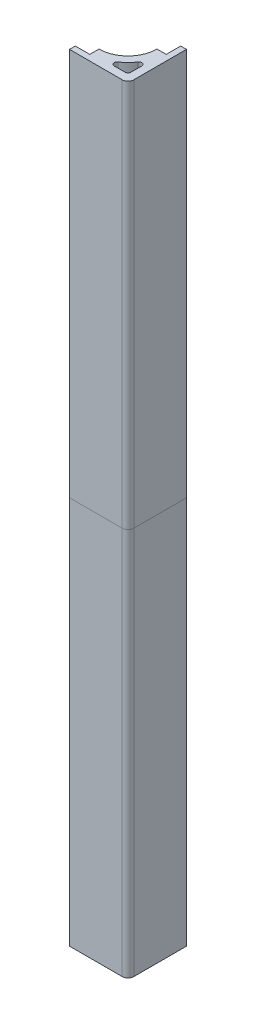
ISO-10303-21;
HEADER;
FILE_DESCRIPTION(('STEP AP214'),'2;1');
FILE_NAME('part.step','',(''),(''),'','','');
FILE_SCHEMA(('AUTOMOTIVE_DESIGN { 1 0 10303 214 1 1 1 1 }'));
ENDSEC;
DATA;
#1=APPLICATION_CONTEXT('core data for automotive mechanical design processes');
#2=APPLICATION_PROTOCOL_DEFINITION('international standard','automotive_design',2000,#1);
#3=PRODUCT_CONTEXT('',#1,'mechanical');
#4=PRODUCT('Part','Part','',(#3));
#5=PRODUCT_RELATED_PRODUCT_CATEGORY('part','',(#4));
#6=PRODUCT_DEFINITION_FORMATION('','',#4);
#7=PRODUCT_DEFINITION_CONTEXT('part definition',#1,'design');
#8=PRODUCT_DEFINITION('design','',#6,#7);
#9=PRODUCT_DEFINITION_SHAPE('','',#8);
#10=(LENGTH_UNIT() NAMED_UNIT(*) SI_UNIT(.MILLI.,.METRE.));
#11=(NAMED_UNIT(*) PLANE_ANGLE_UNIT() SI_UNIT($,.RADIAN.));
#12=(NAMED_UNIT(*) SI_UNIT($,.STERADIAN.) SOLID_ANGLE_UNIT());
#13=UNCERTAINTY_MEASURE_WITH_UNIT(LENGTH_MEASURE(1.E-05),#10,'distance_accuracy_value','');
#14=(GEOMETRIC_REPRESENTATION_CONTEXT(3) GLOBAL_UNCERTAINTY_ASSIGNED_CONTEXT((#13)) GLOBAL_UNIT_ASSIGNED_CONTEXT((#10,
#11,#12)) REPRESENTATION_CONTEXT('',''));
#15=CARTESIAN_POINT('',(0.,0.,0.));
#16=DIRECTION('',(0.,0.,1.));
#17=DIRECTION('',(1.,0.,0.));
#18=AXIS2_PLACEMENT_3D('',#15,#16,#17);
#19=CARTESIAN_POINT('',(0.,0.,0.));
#20=DIRECTION('',(0.,1.,0.));
#21=DIRECTION('',(0.,0.,1.));
#22=AXIS2_PLACEMENT_3D('',#19,#20,#21);
#23=PLANE('',#22);
#24=DIRECTION('',(1.,0.,0.));
#25=VECTOR('',#24,1.);
#26=CARTESIAN_POINT('',(-20.175,0.,0.));
#27=LINE('',#26,#25);
#28=CARTESIAN_POINT('',(-20.175,0.,0.));
#29=VERTEX_POINT('',#28);
#30=CARTESIAN_POINT('',(-2.00000000000001,0.,0.));
#31=VERTEX_POINT('',#30);
#32=EDGE_CURVE('E301',#29,#31,#27,.T.);
#33=ORIENTED_EDGE('',*,*,#32,.T.);
#34=CARTESIAN_POINT('',(-2.,0.,-2.));
#35=DIRECTION('',(0.,1.,0.));
#36=DIRECTION('',(0.,0.,1.));
#37=AXIS2_PLACEMENT_3D('',#34,#35,#36);
#38=CIRCLE('',#37,2.);
#39=CARTESIAN_POINT('',(0.,0.,-2.00000000000001));
#40=VERTEX_POINT('',#39);
#41=EDGE_CURVE('E196',#31,#40,#38,.T.);
#42=ORIENTED_EDGE('',*,*,#41,.T.);
#43=DIRECTION('',(0.,0.,-1.));
#44=VECTOR('',#43,1.);
#45=CARTESIAN_POINT('',(0.,0.,-2.00000000000001));
#46=LINE('',#45,#44);
#47=CARTESIAN_POINT('',(0.,0.,-20.175));
#48=VERTEX_POINT('',#47);
#49=EDGE_CURVE('E277',#40,#48,#46,.T.);
#50=ORIENTED_EDGE('',*,*,#49,.T.);
#51=DIRECTION('',(-1.,0.,0.));
#52=VECTOR('',#51,1.);
#53=CARTESIAN_POINT('',(0.,0.,-20.175));
#54=LINE('',#53,#52);
#55=CARTESIAN_POINT('',(-2.,0.,-20.175));
#56=VERTEX_POINT('',#55);
#57=EDGE_CURVE('E280',#48,#56,#54,.T.);
#58=ORIENTED_EDGE('',*,*,#57,.T.);
#59=DIRECTION('',(0.,0.,1.));
#60=VECTOR('',#59,1.);
#61=CARTESIAN_POINT('',(-2.,0.,-20.175));
#62=LINE('',#61,#60);
#63=CARTESIAN_POINT('',(-2.,0.,-15.175));
#64=VERTEX_POINT('',#63);
#65=EDGE_CURVE('E283',#56,#64,#62,.T.);
#66=ORIENTED_EDGE('',*,*,#65,.T.);
#67=DIRECTION('',(-1.,0.,0.));
#68=VECTOR('',#67,1.);
#69=CARTESIAN_POINT('',(-5.175,0.,-15.175));
#70=LINE('',#69,#68);
#71=CARTESIAN_POINT('',(-5.175,0.,-15.175));
#72=VERTEX_POINT('',#71);
#73=EDGE_CURVE('E286',#64,#72,#70,.T.);
#74=ORIENTED_EDGE('',*,*,#73,.T.);
#75=CARTESIAN_POINT('',(-15.175,0.,-15.175));
#76=DIRECTION('',(0.,1.,0.));
#77=DIRECTION('',(0.,0.,1.));
#78=AXIS2_PLACEMENT_3D('',#75,#76,#77);
#79=CIRCLE('',#78,10.);
#80=CARTESIAN_POINT('',(-15.175,0.,-5.175));
#81=VERTEX_POINT('',#80);
#82=EDGE_CURVE('E289',#72,#81,#79,.F.);
#83=ORIENTED_EDGE('',*,*,#82,.T.);
#84=DIRECTION('',(0.,0.,1.));
#85=VECTOR('',#84,1.);
#86=CARTESIAN_POINT('',(-15.175,0.,-5.175));
#87=LINE('',#86,#85);
#88=CARTESIAN_POINT('',(-15.175,0.,-2.));
#89=VERTEX_POINT('',#88);
#90=EDGE_CURVE('E292',#81,#89,#87,.T.);
#91=ORIENTED_EDGE('',*,*,#90,.T.);
#92=DIRECTION('',(-1.,0.,0.));
#93=VECTOR('',#92,1.);
#94=CARTESIAN_POINT('',(-15.175,0.,-2.));
#95=LINE('',#94,#93);
#96=CARTESIAN_POINT('',(-20.175,0.,-2.));
#97=VERTEX_POINT('',#96);
#98=EDGE_CURVE('E295',#89,#97,#95,.T.);
#99=ORIENTED_EDGE('',*,*,#98,.T.);
#100=DIRECTION('',(0.,0.,1.));
#101=VECTOR('',#100,1.);
#102=CARTESIAN_POINT('',(-20.175,0.,-2.));
#103=LINE('',#102,#101);
#104=EDGE_CURVE('E298',#97,#29,#103,.T.);
#105=ORIENTED_EDGE('',*,*,#104,.T.);
#106=EDGE_LOOP('',(#33,#42,#50,#58,#66,#74,#83,#91,#99,#105));
#107=FACE_BOUND('',#106,.T.);
#108=CARTESIAN_POINT('',(-15.175,0.,-15.175));
#109=DIRECTION('',(0.,1.,0.));
#110=DIRECTION('',(0.,0.,1.));
#111=AXIS2_PLACEMENT_3D('',#108,#109,#110);
#112=CIRCLE('',#111,12.75);
#113=CARTESIAN_POINT('',(-4.58090909090909,0.,-8.08079547729857));
#114=VERTEX_POINT('',#113);
#115=CARTESIAN_POINT('',(-8.08079547729857,0.,-4.58090909090909));
#116=VERTEX_POINT('',#115);
#117=EDGE_CURVE('E195',#114,#116,#112,.F.);
#118=ORIENTED_EDGE('',*,*,#117,.F.);
#119=CARTESIAN_POINT('',(-3.75,0.,-7.52438727943964));
#120=DIRECTION('',(0.,1.,0.));
#121=DIRECTION('',(0.,0.,1.));
#122=AXIS2_PLACEMENT_3D('',#119,#120,#121);
#123=CIRCLE('',#122,1.);
#124=CARTESIAN_POINT('',(-2.75,0.,-7.52438727943964));
#125=VERTEX_POINT('',#124);
#126=EDGE_CURVE('E194',#114,#125,#123,.F.);
#127=ORIENTED_EDGE('',*,*,#126,.T.);
#128=DIRECTION('',(0.,0.,-1.));
#129=VECTOR('',#128,1.);
#130=CARTESIAN_POINT('',(-2.75,0.,-2.00000000000001));
#131=LINE('',#130,#129);
#132=CARTESIAN_POINT('',(-2.75,0.,-3.75));
#133=VERTEX_POINT('',#132);
#134=EDGE_CURVE('E180',#133,#125,#131,.T.);
#135=ORIENTED_EDGE('',*,*,#134,.F.);
#136=CARTESIAN_POINT('',(-3.75,0.,-3.75));
#137=DIRECTION('',(0.,1.,0.));
#138=DIRECTION('',(0.,0.,1.));
#139=AXIS2_PLACEMENT_3D('',#136,#137,#138);
#140=CIRCLE('',#139,1.);
#141=CARTESIAN_POINT('',(-3.75,0.,-2.75));
#142=VERTEX_POINT('',#141);
#143=EDGE_CURVE('E192',#133,#142,#140,.F.);
#144=ORIENTED_EDGE('',*,*,#143,.T.);
#145=DIRECTION('',(1.,0.,0.));
#146=VECTOR('',#145,1.);
#147=CARTESIAN_POINT('',(-20.175,0.,-2.75));
#148=LINE('',#147,#146);
#149=CARTESIAN_POINT('',(-7.52438727943964,0.,-2.75));
#150=VERTEX_POINT('',#149);
#151=EDGE_CURVE('E270',#150,#142,#148,.T.);
#152=ORIENTED_EDGE('',*,*,#151,.F.);
#153=CARTESIAN_POINT('',(-7.52438727943964,0.,-3.75));
#154=DIRECTION('',(0.,1.,0.));
#155=DIRECTION('',(0.,0.,1.));
#156=AXIS2_PLACEMENT_3D('',#153,#154,#155);
#157=CIRCLE('',#156,1.);
#158=EDGE_CURVE('E202',#150,#116,#157,.F.);
#159=ORIENTED_EDGE('',*,*,#158,.T.);
#160=EDGE_LOOP('',(#118,#127,#135,#144,#152,#159));
#161=FACE_BOUND('',#160,.T.);
#162=ADVANCED_FACE('F60',(#107,#161),#23,.T.);
#163=CARTESIAN_POINT('',(-2.,133.95,-2.));
#164=DIRECTION('',(0.,-1.,0.));
#165=DIRECTION('',(0.,0.,-1.));
#166=AXIS2_PLACEMENT_3D('',#163,#164,#165);
#167=CYLINDRICAL_SURFACE('',#166,2.);
#168=ORIENTED_EDGE('',*,*,#41,.F.);
#169=DIRECTION('',(0.,-1.,0.));
#170=VECTOR('',#169,1.);
#171=CARTESIAN_POINT('',(-2.00000000000001,133.95,0.));
#172=LINE('',#171,#170);
#173=CARTESIAN_POINT('',(-2.00000000000001,-133.95,0.));
#174=VERTEX_POINT('',#173);
#175=EDGE_CURVE('E64',#31,#174,#172,.T.);
#176=ORIENTED_EDGE('',*,*,#175,.T.);
#177=CARTESIAN_POINT('',(-2.,-133.95,-2.));
#178=DIRECTION('',(0.,1.,0.));
#179=DIRECTION('',(0.,0.,1.));
#180=AXIS2_PLACEMENT_3D('',#177,#178,#179);
#181=CIRCLE('',#180,2.);
#182=CARTESIAN_POINT('',(0.,-133.95,-2.00000000000001));
#183=VERTEX_POINT('',#182);
#184=EDGE_CURVE('E263',#174,#183,#181,.T.);
#185=ORIENTED_EDGE('',*,*,#184,.T.);
#186=DIRECTION('',(0.,-1.,0.));
#187=VECTOR('',#186,1.);
#188=CARTESIAN_POINT('',(0.,133.95,-2.00000000000001));
#189=LINE('',#188,#187);
#190=EDGE_CURVE('E77',#40,#183,#189,.T.);
#191=ORIENTED_EDGE('',*,*,#190,.F.);
#192=EDGE_LOOP('',(#168,#176,#185,#191));
#193=FACE_BOUND('',#192,.T.);
#194=ADVANCED_FACE('F334',(#193),#167,.T.);
#195=CARTESIAN_POINT('',(0.,133.95,-2.00000000000001));
#196=DIRECTION('',(-1.,0.,0.));
#197=DIRECTION('',(0.,0.,1.));
#198=AXIS2_PLACEMENT_3D('',#195,#196,#197);
#199=PLANE('',#198);
#200=ORIENTED_EDGE('',*,*,#49,.F.);
#201=ORIENTED_EDGE('',*,*,#190,.T.);
#202=DIRECTION('',(0.,0.,-1.));
#203=VECTOR('',#202,1.);
#204=CARTESIAN_POINT('',(0.,-133.95,-2.00000000000001));
#205=LINE('',#204,#203);
#206=CARTESIAN_POINT('',(0.,-133.95,-20.175));
#207=VERTEX_POINT('',#206);
#208=EDGE_CURVE('E261',#183,#207,#205,.T.);
#209=ORIENTED_EDGE('',*,*,#208,.T.);
#210=DIRECTION('',(0.,-1.,0.));
#211=VECTOR('',#210,1.);
#212=CARTESIAN_POINT('',(0.,133.95,-20.175));
#213=LINE('',#212,#211);
#214=EDGE_CURVE('E85',#48,#207,#213,.T.);
#215=ORIENTED_EDGE('',*,*,#214,.F.);
#216=EDGE_LOOP('',(#200,#201,#209,#215));
#217=FACE_BOUND('',#216,.T.);
#218=ADVANCED_FACE('F336',(#217),#199,.F.);
#219=CARTESIAN_POINT('',(0.,133.95,-20.175));
#220=DIRECTION('',(0.,0.,1.));
#221=DIRECTION('',(1.,0.,0.));
#222=AXIS2_PLACEMENT_3D('',#219,#220,#221);
#223=PLANE('',#222);
#224=ORIENTED_EDGE('',*,*,#57,.F.);
#225=ORIENTED_EDGE('',*,*,#214,.T.);
#226=DIRECTION('',(-1.,0.,0.));
#227=VECTOR('',#226,1.);
#228=CARTESIAN_POINT('',(0.,-133.95,-20.175));
#229=LINE('',#228,#227);
#230=CARTESIAN_POINT('',(-2.,-133.95,-20.175));
#231=VERTEX_POINT('',#230);
#232=EDGE_CURVE('E259',#207,#231,#229,.T.);
#233=ORIENTED_EDGE('',*,*,#232,.T.);
#234=DIRECTION('',(0.,-1.,0.));
#235=VECTOR('',#234,1.);
#236=CARTESIAN_POINT('',(-2.,133.95,-20.175));
#237=LINE('',#236,#235);
#238=EDGE_CURVE('E216',#56,#231,#237,.T.);
#239=ORIENTED_EDGE('',*,*,#238,.F.);
#240=EDGE_LOOP('',(#224,#225,#233,#239));
#241=FACE_BOUND('',#240,.T.);
#242=ADVANCED_FACE('F342',(#241),#223,.F.);
#243=CARTESIAN_POINT('',(-2.,133.95,-20.175));
#244=DIRECTION('',(1.,0.,0.));
#245=DIRECTION('',(0.,0.,-1.));
#246=AXIS2_PLACEMENT_3D('',#243,#244,#245);
#247=PLANE('',#246);
#248=ORIENTED_EDGE('',*,*,#65,.F.);
#249=ORIENTED_EDGE('',*,*,#238,.T.);
#250=DIRECTION('',(0.,0.,1.));
#251=VECTOR('',#250,1.);
#252=CARTESIAN_POINT('',(-2.,-133.95,-20.175));
#253=LINE('',#252,#251);
#254=CARTESIAN_POINT('',(-2.,-133.95,-15.175));
#255=VERTEX_POINT('',#254);
#256=EDGE_CURVE('E256',#231,#255,#253,.T.);
#257=ORIENTED_EDGE('',*,*,#256,.T.);
#258=DIRECTION('',(0.,-1.,0.));
#259=VECTOR('',#258,1.);
#260=CARTESIAN_POINT('',(-2.,133.95,-15.175));
#261=LINE('',#260,#259);
#262=EDGE_CURVE('E218',#64,#255,#261,.T.);
#263=ORIENTED_EDGE('',*,*,#262,.F.);
#264=EDGE_LOOP('',(#248,#249,#257,#263));
#265=FACE_BOUND('',#264,.T.);
#266=ADVANCED_FACE('F365',(#265),#247,.F.);
#267=CARTESIAN_POINT('',(-5.175,133.95,-15.175));
#268=DIRECTION('',(0.,0.,1.));
#269=DIRECTION('',(1.,0.,0.));
#270=AXIS2_PLACEMENT_3D('',#267,#268,#269);
#271=PLANE('',#270);
#272=ORIENTED_EDGE('',*,*,#73,.F.);
#273=ORIENTED_EDGE('',*,*,#262,.T.);
#274=DIRECTION('',(-1.,0.,0.));
#275=VECTOR('',#274,1.);
#276=CARTESIAN_POINT('',(-5.175,-133.95,-15.175));
#277=LINE('',#276,#275);
#278=CARTESIAN_POINT('',(-5.175,-133.95,-15.175));
#279=VERTEX_POINT('',#278);
#280=EDGE_CURVE('E253',#255,#279,#277,.T.);
#281=ORIENTED_EDGE('',*,*,#280,.T.);
#282=DIRECTION('',(0.,-1.,0.));
#283=VECTOR('',#282,1.);
#284=CARTESIAN_POINT('',(-5.175,133.95,-15.175));
#285=LINE('',#284,#283);
#286=EDGE_CURVE('E220',#72,#279,#285,.T.);
#287=ORIENTED_EDGE('',*,*,#286,.F.);
#288=EDGE_LOOP('',(#272,#273,#281,#287));
#289=FACE_BOUND('',#288,.T.);
#290=ADVANCED_FACE('F367',(#289),#271,.F.);
#291=CARTESIAN_POINT('',(-15.175,133.95,-15.175));
#292=DIRECTION('',(0.,-1.,0.));
#293=DIRECTION('',(0.,0.,-1.));
#294=AXIS2_PLACEMENT_3D('',#291,#292,#293);
#295=CYLINDRICAL_SURFACE('',#294,10.);
#296=ORIENTED_EDGE('',*,*,#82,.F.);
#297=ORIENTED_EDGE('',*,*,#286,.T.);
#298=CARTESIAN_POINT('',(-15.175,-133.95,-15.175));
#299=DIRECTION('',(0.,-1.,0.));
#300=DIRECTION('',(0.,0.,1.));
#301=AXIS2_PLACEMENT_3D('',#298,#299,#300);
#302=CIRCLE('',#301,10.);
#303=CARTESIAN_POINT('',(-15.175,-133.95,-5.175));
#304=VERTEX_POINT('',#303);
#305=EDGE_CURVE('E250',#279,#304,#302,.T.);
#306=ORIENTED_EDGE('',*,*,#305,.T.);
#307=DIRECTION('',(0.,-1.,0.));
#308=VECTOR('',#307,1.);
#309=CARTESIAN_POINT('',(-15.175,133.95,-5.175));
#310=LINE('',#309,#308);
#311=EDGE_CURVE('E222',#81,#304,#310,.T.);
#312=ORIENTED_EDGE('',*,*,#311,.F.);
#313=EDGE_LOOP('',(#296,#297,#306,#312));
#314=FACE_BOUND('',#313,.T.);
#315=ADVANCED_FACE('F372',(#314),#295,.F.);
#316=CARTESIAN_POINT('',(-15.175,133.95,-5.175));
#317=DIRECTION('',(1.,0.,0.));
#318=DIRECTION('',(0.,0.,-1.));
#319=AXIS2_PLACEMENT_3D('',#316,#317,#318);
#320=PLANE('',#319);
#321=ORIENTED_EDGE('',*,*,#90,.F.);
#322=ORIENTED_EDGE('',*,*,#311,.T.);
#323=DIRECTION('',(0.,0.,1.));
#324=VECTOR('',#323,1.);
#325=CARTESIAN_POINT('',(-15.175,-133.95,-5.175));
#326=LINE('',#325,#324);
#327=CARTESIAN_POINT('',(-15.175,-133.95,-2.));
#328=VERTEX_POINT('',#327);
#329=EDGE_CURVE('E247',#304,#328,#326,.T.);
#330=ORIENTED_EDGE('',*,*,#329,.T.);
#331=DIRECTION('',(0.,-1.,0.));
#332=VECTOR('',#331,1.);
#333=CARTESIAN_POINT('',(-15.175,133.95,-2.));
#334=LINE('',#333,#332);
#335=EDGE_CURVE('E224',#89,#328,#334,.T.);
#336=ORIENTED_EDGE('',*,*,#335,.F.);
#337=EDGE_LOOP('',(#321,#322,#330,#336));
#338=FACE_BOUND('',#337,.T.);
#339=ADVANCED_FACE('F355',(#338),#320,.F.);
#340=CARTESIAN_POINT('',(-15.175,133.95,-2.));
#341=DIRECTION('',(0.,0.,1.));
#342=DIRECTION('',(1.,0.,0.));
#343=AXIS2_PLACEMENT_3D('',#340,#341,#342);
#344=PLANE('',#343);
#345=ORIENTED_EDGE('',*,*,#98,.F.);
#346=ORIENTED_EDGE('',*,*,#335,.T.);
#347=DIRECTION('',(-1.,0.,0.));
#348=VECTOR('',#347,1.);
#349=CARTESIAN_POINT('',(-15.175,-133.95,-2.));
#350=LINE('',#349,#348);
#351=CARTESIAN_POINT('',(-20.175,-133.95,-2.));
#352=VERTEX_POINT('',#351);
#353=EDGE_CURVE('E240',#328,#352,#350,.T.);
#354=ORIENTED_EDGE('',*,*,#353,.T.);
#355=DIRECTION('',(0.,-1.,0.));
#356=VECTOR('',#355,1.);
#357=CARTESIAN_POINT('',(-20.175,133.95,-2.));
#358=LINE('',#357,#356);
#359=EDGE_CURVE('E226',#97,#352,#358,.T.);
#360=ORIENTED_EDGE('',*,*,#359,.F.);
#361=EDGE_LOOP('',(#345,#346,#354,#360));
#362=FACE_BOUND('',#361,.T.);
#363=ADVANCED_FACE('F349',(#362),#344,.F.);
#364=CARTESIAN_POINT('',(-20.175,133.95,-2.));
#365=DIRECTION('',(1.,0.,0.));
#366=DIRECTION('',(0.,0.,-1.));
#367=AXIS2_PLACEMENT_3D('',#364,#365,#366);
#368=PLANE('',#367);
#369=ORIENTED_EDGE('',*,*,#104,.F.);
#370=ORIENTED_EDGE('',*,*,#359,.T.);
#371=DIRECTION('',(0.,0.,1.));
#372=VECTOR('',#371,1.);
#373=CARTESIAN_POINT('',(-20.175,-133.95,-2.));
#374=LINE('',#373,#372);
#375=CARTESIAN_POINT('',(-20.175,-133.95,0.));
#376=VERTEX_POINT('',#375);
#377=EDGE_CURVE('E236',#352,#376,#374,.T.);
#378=ORIENTED_EDGE('',*,*,#377,.T.);
#379=DIRECTION('',(0.,-1.,0.));
#380=VECTOR('',#379,1.);
#381=CARTESIAN_POINT('',(-20.175,133.95,0.));
#382=LINE('',#381,#380);
#383=EDGE_CURVE('E227',#29,#376,#382,.T.);
#384=ORIENTED_EDGE('',*,*,#383,.F.);
#385=EDGE_LOOP('',(#369,#370,#378,#384));
#386=FACE_BOUND('',#385,.T.);
#387=ADVANCED_FACE('F347',(#386),#368,.F.);
#388=CARTESIAN_POINT('',(-20.175,133.95,0.));
#389=DIRECTION('',(0.,0.,-1.));
#390=DIRECTION('',(-1.,0.,0.));
#391=AXIS2_PLACEMENT_3D('',#388,#389,#390);
#392=PLANE('',#391);
#393=ORIENTED_EDGE('',*,*,#32,.F.);
#394=ORIENTED_EDGE('',*,*,#383,.T.);
#395=DIRECTION('',(1.,0.,0.));
#396=VECTOR('',#395,1.);
#397=CARTESIAN_POINT('',(-20.175,-133.95,0.));
#398=LINE('',#397,#396);
#399=EDGE_CURVE('E232',#376,#174,#398,.T.);
#400=ORIENTED_EDGE('',*,*,#399,.T.);
#401=ORIENTED_EDGE('',*,*,#175,.F.);
#402=EDGE_LOOP('',(#393,#394,#400,#401));
#403=FACE_BOUND('',#402,.T.);
#404=ADVANCED_FACE('F62',(#403),#392,.F.);
#405=CARTESIAN_POINT('',(-2.75,133.95,-2.00000000000001));
#406=DIRECTION('',(-1.,0.,0.));
#407=DIRECTION('',(0.,0.,1.));
#408=AXIS2_PLACEMENT_3D('',#405,#406,#407);
#409=PLANE('',#408);
#410=DIRECTION('',(0.,-1.,0.));
#411=VECTOR('',#410,1.);
#412=CARTESIAN_POINT('',(-2.75,133.95,-3.75));
#413=LINE('',#412,#411);
#414=CARTESIAN_POINT('',(-2.75,-133.95,-3.75));
#415=VERTEX_POINT('',#414);
#416=EDGE_CURVE('E177',#415,#133,#413,.F.);
#417=ORIENTED_EDGE('',*,*,#416,.T.);
#418=ORIENTED_EDGE('',*,*,#134,.T.);
#419=DIRECTION('',(0.,1.,0.));
#420=VECTOR('',#419,1.);
#421=CARTESIAN_POINT('',(-2.75,-133.95,-7.52438727943964));
#422=LINE('',#421,#420);
#423=CARTESIAN_POINT('',(-2.75,-133.95,-7.52438727943964));
#424=VERTEX_POINT('',#423);
#425=EDGE_CURVE('E186',#125,#424,#422,.F.);
#426=ORIENTED_EDGE('',*,*,#425,.T.);
#427=DIRECTION('',(0.,0.,-1.));
#428=VECTOR('',#427,1.);
#429=CARTESIAN_POINT('',(-2.75,-133.95,-2.00000000000001));
#430=LINE('',#429,#428);
#431=EDGE_CURVE('E13',#415,#424,#430,.T.);
#432=ORIENTED_EDGE('',*,*,#431,.F.);
#433=EDGE_LOOP('',(#417,#418,#426,#432));
#434=FACE_BOUND('',#433,.T.);
#435=ADVANCED_FACE('F179',(#434),#409,.T.);
#436=CARTESIAN_POINT('',(-15.175,133.95,-15.175));
#437=DIRECTION('',(0.,-1.,0.));
#438=DIRECTION('',(0.,0.,-1.));
#439=AXIS2_PLACEMENT_3D('',#436,#437,#438);
#440=CYLINDRICAL_SURFACE('',#439,12.75);
#441=DIRECTION('',(0.,-1.,0.));
#442=VECTOR('',#441,1.);
#443=CARTESIAN_POINT('',(-4.58090909090909,133.95,-8.08079547729857));
#444=LINE('',#443,#442);
#445=CARTESIAN_POINT('',(-4.58090909090909,-133.95,-8.08079547729857));
#446=VERTEX_POINT('',#445);
#447=EDGE_CURVE('E212',#446,#114,#444,.F.);
#448=ORIENTED_EDGE('',*,*,#447,.T.);
#449=ORIENTED_EDGE('',*,*,#117,.T.);
#450=DIRECTION('',(0.,-1.,0.));
#451=VECTOR('',#450,1.);
#452=CARTESIAN_POINT('',(-8.08079547729857,133.95,-4.58090909090909));
#453=LINE('',#452,#451);
#454=CARTESIAN_POINT('',(-8.08079547729857,-133.95,-4.58090909090909));
#455=VERTEX_POINT('',#454);
#456=EDGE_CURVE('E210',#116,#455,#453,.T.);
#457=ORIENTED_EDGE('',*,*,#456,.T.);
#458=CARTESIAN_POINT('',(-15.175,-133.95,-15.175));
#459=DIRECTION('',(0.,1.,0.));
#460=DIRECTION('',(0.,0.,1.));
#461=AXIS2_PLACEMENT_3D('',#458,#459,#460);
#462=CIRCLE('',#461,12.75);
#463=EDGE_CURVE('E69',#446,#455,#462,.F.);
#464=ORIENTED_EDGE('',*,*,#463,.F.);
#465=EDGE_LOOP('',(#448,#449,#457,#464));
#466=FACE_BOUND('',#465,.T.);
#467=ADVANCED_FACE('F311',(#466),#440,.T.);
#468=CARTESIAN_POINT('',(-20.175,133.95,-2.75));
#469=DIRECTION('',(0.,0.,-1.));
#470=DIRECTION('',(-1.,0.,0.));
#471=AXIS2_PLACEMENT_3D('',#468,#469,#470);
#472=PLANE('',#471);
#473=DIRECTION('',(0.,1.,0.));
#474=VECTOR('',#473,1.);
#475=CARTESIAN_POINT('',(-7.52438727943964,133.95,-2.75));
#476=LINE('',#475,#474);
#477=CARTESIAN_POINT('',(-7.52438727943964,-133.95,-2.75));
#478=VERTEX_POINT('',#477);
#479=EDGE_CURVE('E185',#478,#150,#476,.T.);
#480=ORIENTED_EDGE('',*,*,#479,.T.);
#481=ORIENTED_EDGE('',*,*,#151,.T.);
#482=DIRECTION('',(0.,-1.,0.));
#483=VECTOR('',#482,1.);
#484=CARTESIAN_POINT('',(-3.75,-133.95,-2.75));
#485=LINE('',#484,#483);
#486=CARTESIAN_POINT('',(-3.75,-133.95,-2.75));
#487=VERTEX_POINT('',#486);
#488=EDGE_CURVE('E199',#142,#487,#485,.T.);
#489=ORIENTED_EDGE('',*,*,#488,.T.);
#490=DIRECTION('',(1.,0.,0.));
#491=VECTOR('',#490,1.);
#492=CARTESIAN_POINT('',(-20.175,-133.95,-2.75));
#493=LINE('',#492,#491);
#494=EDGE_CURVE('E265',#478,#487,#493,.T.);
#495=ORIENTED_EDGE('',*,*,#494,.F.);
#496=EDGE_LOOP('',(#480,#481,#489,#495));
#497=FACE_BOUND('',#496,.T.);
#498=ADVANCED_FACE('F323',(#497),#472,.T.);
#499=CARTESIAN_POINT('',(-7.52438727943964,133.95,-3.75));
#500=DIRECTION('',(0.,-1.,0.));
#501=DIRECTION('',(0.,0.,-1.));
#502=AXIS2_PLACEMENT_3D('',#499,#500,#501);
#503=CYLINDRICAL_SURFACE('',#502,1.);
#504=ORIENTED_EDGE('',*,*,#158,.F.);
#505=ORIENTED_EDGE('',*,*,#479,.F.);
#506=CARTESIAN_POINT('',(-7.52438727943964,-133.95,-3.75));
#507=DIRECTION('',(0.,1.,0.));
#508=DIRECTION('',(0.,0.,1.));
#509=AXIS2_PLACEMENT_3D('',#506,#507,#508);
#510=CIRCLE('',#509,1.);
#511=EDGE_CURVE('E206',#455,#478,#510,.T.);
#512=ORIENTED_EDGE('',*,*,#511,.F.);
#513=ORIENTED_EDGE('',*,*,#456,.F.);
#514=EDGE_LOOP('',(#504,#505,#512,#513));
#515=FACE_BOUND('',#514,.T.);
#516=ADVANCED_FACE('F307',(#515),#503,.F.);
#517=CARTESIAN_POINT('',(-3.75,133.95,-7.52438727943964));
#518=DIRECTION('',(0.,-1.,0.));
#519=DIRECTION('',(0.,0.,-1.));
#520=AXIS2_PLACEMENT_3D('',#517,#518,#519);
#521=CYLINDRICAL_SURFACE('',#520,1.);
#522=ORIENTED_EDGE('',*,*,#126,.F.);
#523=ORIENTED_EDGE('',*,*,#447,.F.);
#524=CARTESIAN_POINT('',(-3.75,-133.95,-7.52438727943964));
#525=DIRECTION('',(0.,1.,0.));
#526=DIRECTION('',(0.,0.,1.));
#527=AXIS2_PLACEMENT_3D('',#524,#525,#526);
#528=CIRCLE('',#527,1.);
#529=EDGE_CURVE('E316',#424,#446,#528,.T.);
#530=ORIENTED_EDGE('',*,*,#529,.F.);
#531=ORIENTED_EDGE('',*,*,#425,.F.);
#532=EDGE_LOOP('',(#522,#523,#530,#531));
#533=FACE_BOUND('',#532,.T.);
#534=ADVANCED_FACE('F315',(#533),#521,.F.);
#535=CARTESIAN_POINT('',(-3.75,133.95,-3.75));
#536=DIRECTION('',(0.,1.,0.));
#537=DIRECTION('',(0.,0.,1.));
#538=AXIS2_PLACEMENT_3D('',#535,#536,#537);
#539=CYLINDRICAL_SURFACE('',#538,1.);
#540=ORIENTED_EDGE('',*,*,#143,.F.);
#541=ORIENTED_EDGE('',*,*,#416,.F.);
#542=CARTESIAN_POINT('',(-3.75,-133.95,-3.75));
#543=DIRECTION('',(0.,1.,0.));
#544=DIRECTION('',(0.,0.,1.));
#545=AXIS2_PLACEMENT_3D('',#542,#543,#544);
#546=CIRCLE('',#545,1.);
#547=EDGE_CURVE('E272',#487,#415,#546,.T.);
#548=ORIENTED_EDGE('',*,*,#547,.F.);
#549=ORIENTED_EDGE('',*,*,#488,.F.);
#550=EDGE_LOOP('',(#540,#541,#548,#549));
#551=FACE_BOUND('',#550,.T.);
#552=ADVANCED_FACE('F198',(#551),#539,.F.);
#553=CARTESIAN_POINT('',(-2.,-133.95,-2.));
#554=DIRECTION('',(0.,1.,0.));
#555=DIRECTION('',(0.,0.,1.));
#556=AXIS2_PLACEMENT_3D('',#553,#554,#555);
#557=PLANE('',#556);
#558=ORIENTED_EDGE('',*,*,#494,.T.);
#559=ORIENTED_EDGE('',*,*,#547,.T.);
#560=ORIENTED_EDGE('',*,*,#431,.T.);
#561=ORIENTED_EDGE('',*,*,#529,.T.);
#562=ORIENTED_EDGE('',*,*,#463,.T.);
#563=ORIENTED_EDGE('',*,*,#511,.T.);
#564=EDGE_LOOP('',(#558,#559,#560,#561,#562,#563));
#565=FACE_BOUND('',#564,.T.);
#566=ORIENTED_EDGE('',*,*,#184,.F.);
#567=ORIENTED_EDGE('',*,*,#399,.F.);
#568=ORIENTED_EDGE('',*,*,#377,.F.);
#569=ORIENTED_EDGE('',*,*,#353,.F.);
#570=ORIENTED_EDGE('',*,*,#329,.F.);
#571=ORIENTED_EDGE('',*,*,#305,.F.);
#572=ORIENTED_EDGE('',*,*,#280,.F.);
#573=ORIENTED_EDGE('',*,*,#256,.F.);
#574=ORIENTED_EDGE('',*,*,#232,.F.);
#575=ORIENTED_EDGE('',*,*,#208,.F.);
#576=EDGE_LOOP('',(#566,#567,#568,#569,#570,#571,#572,#573,#574,#575));
#577=FACE_BOUND('',#576,.T.);
#578=ADVANCED_FACE('F318',(#565,#577),#557,.F.);
#579=CLOSED_SHELL('',(#162,#194,#218,#242,#266,#290,#315,#339,#363,#387,#404,#435,#467,#498,
#516,#534,#552,#578));
#580=MANIFOLD_SOLID_BREP('B2',#579);
#581=CARTESIAN_POINT('',(0.,0.,0.));
#582=DIRECTION('',(0.,1.,0.));
#583=DIRECTION('',(0.,0.,1.));
#584=AXIS2_PLACEMENT_3D('',#581,#582,#583);
#585=PLANE('',#584);
#586=CARTESIAN_POINT('',(-15.175,0.,-15.175));
#587=DIRECTION('',(0.,1.,0.));
#588=DIRECTION('',(0.,0.,1.));
#589=AXIS2_PLACEMENT_3D('',#586,#587,#588);
#590=CIRCLE('',#589,12.75);
#591=CARTESIAN_POINT('',(-4.58090909090909,0.,-8.08079547729857));
#592=VERTEX_POINT('',#591);
#593=CARTESIAN_POINT('',(-8.08079547729857,0.,-4.58090909090909));
#594=VERTEX_POINT('',#593);
#595=EDGE_CURVE('E505',#592,#594,#590,.F.);
#596=ORIENTED_EDGE('',*,*,#595,.T.);
#597=CARTESIAN_POINT('',(-7.52438727943964,0.,-3.75));
#598=DIRECTION('',(0.,1.,0.));
#599=DIRECTION('',(0.,0.,1.));
#600=AXIS2_PLACEMENT_3D('',#597,#598,#599);
#601=CIRCLE('',#600,1.);
#602=CARTESIAN_POINT('',(-7.52438727943964,0.,-2.75));
#603=VERTEX_POINT('',#602);
#604=EDGE_CURVE('E677',#603,#594,#601,.F.);
#605=ORIENTED_EDGE('',*,*,#604,.F.);
#606=DIRECTION('',(1.,0.,0.));
#607=VECTOR('',#606,1.);
#608=CARTESIAN_POINT('',(-20.175,0.,-2.75));
#609=LINE('',#608,#607);
#610=CARTESIAN_POINT('',(-3.75,0.,-2.75));
#611=VERTEX_POINT('',#610);
#612=EDGE_CURVE('E58',#603,#611,#609,.T.);
#613=ORIENTED_EDGE('',*,*,#612,.T.);
#614=CARTESIAN_POINT('',(-3.75,0.,-3.75));
#615=DIRECTION('',(0.,1.,0.));
#616=DIRECTION('',(0.,0.,1.));
#617=AXIS2_PLACEMENT_3D('',#614,#615,#616);
#618=CIRCLE('',#617,1.);
#619=CARTESIAN_POINT('',(-2.75,0.,-3.75));
#620=VERTEX_POINT('',#619);
#621=EDGE_CURVE('E667',#620,#611,#618,.F.);
#622=ORIENTED_EDGE('',*,*,#621,.F.);
#623=DIRECTION('',(0.,0.,-1.));
#624=VECTOR('',#623,1.);
#625=CARTESIAN_POINT('',(-2.75,0.,-2.00000000000001));
#626=LINE('',#625,#624);
#627=CARTESIAN_POINT('',(-2.75,0.,-7.52438727943964));
#628=VERTEX_POINT('',#627);
#629=EDGE_CURVE('E671',#620,#628,#626,.T.);
#630=ORIENTED_EDGE('',*,*,#629,.T.);
#631=CARTESIAN_POINT('',(-3.75,0.,-7.52438727943964));
#632=DIRECTION('',(0.,1.,0.));
#633=DIRECTION('',(0.,0.,1.));
#634=AXIS2_PLACEMENT_3D('',#631,#632,#633);
#635=CIRCLE('',#634,1.);
#636=EDGE_CURVE('E669',#592,#628,#635,.F.);
#637=ORIENTED_EDGE('',*,*,#636,.F.);
#638=EDGE_LOOP('',(#596,#605,#613,#622,#630,#637));
#639=FACE_BOUND('',#638,.T.);
#640=DIRECTION('',(1.,0.,0.));
#641=VECTOR('',#640,1.);
#642=CARTESIAN_POINT('',(-20.175,0.,0.));
#643=LINE('',#642,#641);
#644=CARTESIAN_POINT('',(-20.175,0.,0.));
#645=VERTEX_POINT('',#644);
#646=CARTESIAN_POINT('',(-2.00000000000001,0.,0.));
#647=VERTEX_POINT('',#646);
#648=EDGE_CURVE('E680',#645,#647,#643,.T.);
#649=ORIENTED_EDGE('',*,*,#648,.F.);
#650=DIRECTION('',(0.,0.,1.));
#651=VECTOR('',#650,1.);
#652=CARTESIAN_POINT('',(-20.175,0.,-2.));
#653=LINE('',#652,#651);
#654=CARTESIAN_POINT('',(-20.175,0.,-2.));
#655=VERTEX_POINT('',#654);
#656=EDGE_CURVE('E687',#655,#645,#653,.T.);
#657=ORIENTED_EDGE('',*,*,#656,.F.);
#658=DIRECTION('',(-1.,0.,0.));
#659=VECTOR('',#658,1.);
#660=CARTESIAN_POINT('',(-15.175,0.,-2.));
#661=LINE('',#660,#659);
#662=CARTESIAN_POINT('',(-15.175,0.,-2.));
#663=VERTEX_POINT('',#662);
#664=EDGE_CURVE('E690',#663,#655,#661,.T.);
#665=ORIENTED_EDGE('',*,*,#664,.F.);
#666=DIRECTION('',(0.,0.,1.));
#667=VECTOR('',#666,1.);
#668=CARTESIAN_POINT('',(-15.175,0.,-5.175));
#669=LINE('',#668,#667);
#670=CARTESIAN_POINT('',(-15.175,0.,-5.175));
#671=VERTEX_POINT('',#670);
#672=EDGE_CURVE('E693',#671,#663,#669,.T.);
#673=ORIENTED_EDGE('',*,*,#672,.F.);
#674=CARTESIAN_POINT('',(-15.175,0.,-15.175));
#675=DIRECTION('',(0.,1.,0.));
#676=DIRECTION('',(0.,0.,1.));
#677=AXIS2_PLACEMENT_3D('',#674,#675,#676);
#678=CIRCLE('',#677,10.);
#679=CARTESIAN_POINT('',(-5.175,0.,-15.175));
#680=VERTEX_POINT('',#679);
#681=EDGE_CURVE('E696',#680,#671,#678,.F.);
#682=ORIENTED_EDGE('',*,*,#681,.F.);
#683=DIRECTION('',(-1.,0.,0.));
#684=VECTOR('',#683,1.);
#685=CARTESIAN_POINT('',(-5.175,0.,-15.175));
#686=LINE('',#685,#684);
#687=CARTESIAN_POINT('',(-2.,0.,-15.175));
#688=VERTEX_POINT('',#687);
#689=EDGE_CURVE('E699',#688,#680,#686,.T.);
#690=ORIENTED_EDGE('',*,*,#689,.F.);
#691=DIRECTION('',(0.,0.,1.));
#692=VECTOR('',#691,1.);
#693=CARTESIAN_POINT('',(-2.,0.,-20.175));
#694=LINE('',#693,#692);
#695=CARTESIAN_POINT('',(-2.,0.,-20.175));
#696=VERTEX_POINT('',#695);
#697=EDGE_CURVE('E702',#696,#688,#694,.T.);
#698=ORIENTED_EDGE('',*,*,#697,.F.);
#699=DIRECTION('',(-1.,0.,0.));
#700=VECTOR('',#699,1.);
#701=CARTESIAN_POINT('',(0.,0.,-20.175));
#702=LINE('',#701,#700);
#703=CARTESIAN_POINT('',(0.,0.,-20.175));
#704=VERTEX_POINT('',#703);
#705=EDGE_CURVE('E705',#704,#696,#702,.T.);
#706=ORIENTED_EDGE('',*,*,#705,.F.);
#707=DIRECTION('',(0.,0.,-1.));
#708=VECTOR('',#707,1.);
#709=CARTESIAN_POINT('',(0.,0.,-2.00000000000001));
#710=LINE('',#709,#708);
#711=CARTESIAN_POINT('',(0.,0.,-2.00000000000001));
#712=VERTEX_POINT('',#711);
#713=EDGE_CURVE('E519',#712,#704,#710,.T.);
#714=ORIENTED_EDGE('',*,*,#713,.F.);
#715=CARTESIAN_POINT('',(-2.,0.,-2.));
#716=DIRECTION('',(0.,1.,0.));
#717=DIRECTION('',(0.,0.,1.));
#718=AXIS2_PLACEMENT_3D('',#715,#716,#717);
#719=CIRCLE('',#718,2.);
#720=EDGE_CURVE('E499',#647,#712,#719,.T.);
#721=ORIENTED_EDGE('',*,*,#720,.F.);
#722=EDGE_LOOP('',(#649,#657,#665,#673,#682,#690,#698,#706,#714,#721));
#723=FACE_BOUND('',#722,.T.);
#724=ADVANCED_FACE('F496',(#639,#723),#585,.F.);
#725=CARTESIAN_POINT('',(0.,133.95,-2.00000000000001));
#726=DIRECTION('',(-1.,0.,0.));
#727=DIRECTION('',(0.,0.,1.));
#728=AXIS2_PLACEMENT_3D('',#725,#726,#727);
#729=PLANE('',#728);
#730=DIRECTION('',(0.,-1.,0.));
#731=VECTOR('',#730,1.);
#732=CARTESIAN_POINT('',(0.,133.95,-2.00000000000001));
#733=LINE('',#732,#731);
#734=CARTESIAN_POINT('',(0.,133.95,-2.00000000000001));
#735=VERTEX_POINT('',#734);
#736=EDGE_CURVE('E612',#735,#712,#733,.T.);
#737=ORIENTED_EDGE('',*,*,#736,.T.);
#738=ORIENTED_EDGE('',*,*,#713,.T.);
#739=DIRECTION('',(0.,-1.,0.));
#740=VECTOR('',#739,1.);
#741=CARTESIAN_POINT('',(0.,133.95,-20.175));
#742=LINE('',#741,#740);
#743=CARTESIAN_POINT('',(0.,133.95,-20.175));
#744=VERTEX_POINT('',#743);
#745=EDGE_CURVE('E614',#744,#704,#742,.T.);
#746=ORIENTED_EDGE('',*,*,#745,.F.);
#747=DIRECTION('',(0.,0.,-1.));
#748=VECTOR('',#747,1.);
#749=CARTESIAN_POINT('',(0.,133.95,-2.00000000000001));
#750=LINE('',#749,#748);
#751=EDGE_CURVE('E609',#735,#744,#750,.T.);
#752=ORIENTED_EDGE('',*,*,#751,.F.);
#753=EDGE_LOOP('',(#737,#738,#746,#752));
#754=FACE_BOUND('',#753,.T.);
#755=ADVANCED_FACE('F611',(#754),#729,.F.);
#756=CARTESIAN_POINT('',(0.,133.95,-20.175));
#757=DIRECTION('',(0.,0.,1.));
#758=DIRECTION('',(1.,0.,0.));
#759=AXIS2_PLACEMENT_3D('',#756,#757,#758);
#760=PLANE('',#759);
#761=ORIENTED_EDGE('',*,*,#745,.T.);
#762=ORIENTED_EDGE('',*,*,#705,.T.);
#763=DIRECTION('',(0.,-1.,0.));
#764=VECTOR('',#763,1.);
#765=CARTESIAN_POINT('',(-2.,133.95,-20.175));
#766=LINE('',#765,#764);
#767=CARTESIAN_POINT('',(-2.,133.95,-20.175));
#768=VERTEX_POINT('',#767);
#769=EDGE_CURVE('E637',#768,#696,#766,.T.);
#770=ORIENTED_EDGE('',*,*,#769,.F.);
#771=DIRECTION('',(-1.,0.,0.));
#772=VECTOR('',#771,1.);
#773=CARTESIAN_POINT('',(0.,133.95,-20.175));
#774=LINE('',#773,#772);
#775=EDGE_CURVE('E618',#744,#768,#774,.T.);
#776=ORIENTED_EDGE('',*,*,#775,.F.);
#777=EDGE_LOOP('',(#761,#762,#770,#776));
#778=FACE_BOUND('',#777,.T.);
#779=ADVANCED_FACE('F712',(#778),#760,.F.);
#780=CARTESIAN_POINT('',(-2.,133.95,-20.175));
#781=DIRECTION('',(1.,0.,0.));
#782=DIRECTION('',(0.,0.,-1.));
#783=AXIS2_PLACEMENT_3D('',#780,#781,#782);
#784=PLANE('',#783);
#785=ORIENTED_EDGE('',*,*,#769,.T.);
#786=ORIENTED_EDGE('',*,*,#697,.T.);
#787=DIRECTION('',(0.,-1.,0.));
#788=VECTOR('',#787,1.);
#789=CARTESIAN_POINT('',(-2.,133.95,-15.175));
#790=LINE('',#789,#788);
#791=CARTESIAN_POINT('',(-2.,133.95,-15.175));
#792=VERTEX_POINT('',#791);
#793=EDGE_CURVE('E725',#792,#688,#790,.T.);
#794=ORIENTED_EDGE('',*,*,#793,.F.);
#795=DIRECTION('',(0.,0.,1.));
#796=VECTOR('',#795,1.);
#797=CARTESIAN_POINT('',(-2.,133.95,-20.175));
#798=LINE('',#797,#796);
#799=EDGE_CURVE('E723',#768,#792,#798,.T.);
#800=ORIENTED_EDGE('',*,*,#799,.F.);
#801=EDGE_LOOP('',(#785,#786,#794,#800));
#802=FACE_BOUND('',#801,.T.);
#803=ADVANCED_FACE('F722',(#802),#784,.F.);
#804=CARTESIAN_POINT('',(-5.175,133.95,-15.175));
#805=DIRECTION('',(0.,0.,1.));
#806=DIRECTION('',(1.,0.,0.));
#807=AXIS2_PLACEMENT_3D('',#804,#805,#806);
#808=PLANE('',#807);
#809=ORIENTED_EDGE('',*,*,#793,.T.);
#810=ORIENTED_EDGE('',*,*,#689,.T.);
#811=DIRECTION('',(0.,-1.,0.));
#812=VECTOR('',#811,1.);
#813=CARTESIAN_POINT('',(-5.175,133.95,-15.175));
#814=LINE('',#813,#812);
#815=CARTESIAN_POINT('',(-5.175,133.95,-15.175));
#816=VERTEX_POINT('',#815);
#817=EDGE_CURVE('E727',#816,#680,#814,.T.);
#818=ORIENTED_EDGE('',*,*,#817,.F.);
#819=DIRECTION('',(-1.,0.,0.));
#820=VECTOR('',#819,1.);
#821=CARTESIAN_POINT('',(-5.175,133.95,-15.175));
#822=LINE('',#821,#820);
#823=EDGE_CURVE('E766',#792,#816,#822,.T.);
#824=ORIENTED_EDGE('',*,*,#823,.F.);
#825=EDGE_LOOP('',(#809,#810,#818,#824));
#826=FACE_BOUND('',#825,.T.);
#827=ADVANCED_FACE('F850',(#826),#808,.F.);
#828=CARTESIAN_POINT('',(-15.175,133.95,-15.175));
#829=DIRECTION('',(0.,-1.,0.));
#830=DIRECTION('',(0.,0.,-1.));
#831=AXIS2_PLACEMENT_3D('',#828,#829,#830);
#832=CYLINDRICAL_SURFACE('',#831,10.);
#833=ORIENTED_EDGE('',*,*,#817,.T.);
#834=ORIENTED_EDGE('',*,*,#681,.T.);
#835=DIRECTION('',(0.,-1.,0.));
#836=VECTOR('',#835,1.);
#837=CARTESIAN_POINT('',(-15.175,133.95,-5.175));
#838=LINE('',#837,#836);
#839=CARTESIAN_POINT('',(-15.175,133.95,-5.175));
#840=VERTEX_POINT('',#839);
#841=EDGE_CURVE('E733',#840,#671,#838,.T.);
#842=ORIENTED_EDGE('',*,*,#841,.F.);
#843=CARTESIAN_POINT('',(-15.175,133.95,-15.175));
#844=DIRECTION('',(0.,-1.,0.));
#845=DIRECTION('',(0.,0.,1.));
#846=AXIS2_PLACEMENT_3D('',#843,#844,#845);
#847=CIRCLE('',#846,10.);
#848=EDGE_CURVE('E763',#816,#840,#847,.T.);
#849=ORIENTED_EDGE('',*,*,#848,.F.);
#850=EDGE_LOOP('',(#833,#834,#842,#849));
#851=FACE_BOUND('',#850,.T.);
#852=ADVANCED_FACE('F846',(#851),#832,.F.);
#853=CARTESIAN_POINT('',(-15.175,133.95,-5.175));
#854=DIRECTION('',(1.,0.,0.));
#855=DIRECTION('',(0.,0.,-1.));
#856=AXIS2_PLACEMENT_3D('',#853,#854,#855);
#857=PLANE('',#856);
#858=ORIENTED_EDGE('',*,*,#841,.T.);
#859=ORIENTED_EDGE('',*,*,#672,.T.);
#860=DIRECTION('',(0.,-1.,0.));
#861=VECTOR('',#860,1.);
#862=CARTESIAN_POINT('',(-15.175,133.95,-2.));
#863=LINE('',#862,#861);
#864=CARTESIAN_POINT('',(-15.175,133.95,-2.));
#865=VERTEX_POINT('',#864);
#866=EDGE_CURVE('E737',#865,#663,#863,.T.);
#867=ORIENTED_EDGE('',*,*,#866,.F.);
#868=DIRECTION('',(0.,0.,1.));
#869=VECTOR('',#868,1.);
#870=CARTESIAN_POINT('',(-15.175,133.95,-5.175));
#871=LINE('',#870,#869);
#872=EDGE_CURVE('E760',#840,#865,#871,.T.);
#873=ORIENTED_EDGE('',*,*,#872,.F.);
#874=EDGE_LOOP('',(#858,#859,#867,#873));
#875=FACE_BOUND('',#874,.T.);
#876=ADVANCED_FACE('F842',(#875),#857,.F.);
#877=CARTESIAN_POINT('',(-15.175,133.95,-2.));
#878=DIRECTION('',(0.,0.,1.));
#879=DIRECTION('',(1.,0.,0.));
#880=AXIS2_PLACEMENT_3D('',#877,#878,#879);
#881=PLANE('',#880);
#882=ORIENTED_EDGE('',*,*,#866,.T.);
#883=ORIENTED_EDGE('',*,*,#664,.T.);
#884=DIRECTION('',(0.,-1.,0.));
#885=VECTOR('',#884,1.);
#886=CARTESIAN_POINT('',(-20.175,133.95,-2.));
#887=LINE('',#886,#885);
#888=CARTESIAN_POINT('',(-20.175,133.95,-2.));
#889=VERTEX_POINT('',#888);
#890=EDGE_CURVE('E741',#889,#655,#887,.T.);
#891=ORIENTED_EDGE('',*,*,#890,.F.);
#892=DIRECTION('',(-1.,0.,0.));
#893=VECTOR('',#892,1.);
#894=CARTESIAN_POINT('',(-15.175,133.95,-2.));
#895=LINE('',#894,#893);
#896=EDGE_CURVE('E757',#865,#889,#895,.T.);
#897=ORIENTED_EDGE('',*,*,#896,.F.);
#898=EDGE_LOOP('',(#882,#883,#891,#897));
#899=FACE_BOUND('',#898,.T.);
#900=ADVANCED_FACE('F839',(#899),#881,.F.);
#901=CARTESIAN_POINT('',(-2.,133.95,-2.));
#902=DIRECTION('',(0.,1.,0.));
#903=DIRECTION('',(0.,0.,1.));
#904=AXIS2_PLACEMENT_3D('',#901,#902,#903);
#905=PLANE('',#904);
#906=CARTESIAN_POINT('',(-15.175,133.95,-15.175));
#907=DIRECTION('',(0.,1.,0.));
#908=DIRECTION('',(0.,0.,1.));
#909=AXIS2_PLACEMENT_3D('',#906,#907,#908);
#910=CIRCLE('',#909,12.75);
#911=CARTESIAN_POINT('',(-4.58090909090909,133.95,-8.08079547729857));
#912=VERTEX_POINT('',#911);
#913=CARTESIAN_POINT('',(-8.08079547729857,133.95,-4.58090909090909));
#914=VERTEX_POINT('',#913);
#915=EDGE_CURVE('E776',#912,#914,#910,.F.);
#916=ORIENTED_EDGE('',*,*,#915,.F.);
#917=CARTESIAN_POINT('',(-3.75,133.95,-7.52438727943964));
#918=DIRECTION('',(0.,1.,0.));
#919=DIRECTION('',(0.,0.,1.));
#920=AXIS2_PLACEMENT_3D('',#917,#918,#919);
#921=CIRCLE('',#920,1.);
#922=CARTESIAN_POINT('',(-2.75,133.95,-7.52438727943964));
#923=VERTEX_POINT('',#922);
#924=EDGE_CURVE('E661',#912,#923,#921,.F.);
#925=ORIENTED_EDGE('',*,*,#924,.T.);
#926=DIRECTION('',(0.,0.,-1.));
#927=VECTOR('',#926,1.);
#928=CARTESIAN_POINT('',(-2.75,133.95,-2.00000000000001));
#929=LINE('',#928,#927);
#930=CARTESIAN_POINT('',(-2.75,133.95,-3.75));
#931=VERTEX_POINT('',#930);
#932=EDGE_CURVE('E780',#931,#923,#929,.T.);
#933=ORIENTED_EDGE('',*,*,#932,.F.);
#934=CARTESIAN_POINT('',(-3.75,133.95,-3.75));
#935=DIRECTION('',(0.,1.,0.));
#936=DIRECTION('',(0.,0.,1.));
#937=AXIS2_PLACEMENT_3D('',#934,#935,#936);
#938=CIRCLE('',#937,1.);
#939=CARTESIAN_POINT('',(-3.75,133.95,-2.75));
#940=VERTEX_POINT('',#939);
#941=EDGE_CURVE('E664',#931,#940,#938,.F.);
#942=ORIENTED_EDGE('',*,*,#941,.T.);
#943=DIRECTION('',(1.,0.,0.));
#944=VECTOR('',#943,1.);
#945=CARTESIAN_POINT('',(-20.175,133.95,-2.75));
#946=LINE('',#945,#944);
#947=CARTESIAN_POINT('',(-7.52438727943964,133.95,-2.75));
#948=VERTEX_POINT('',#947);
#949=EDGE_CURVE('E627',#948,#940,#946,.T.);
#950=ORIENTED_EDGE('',*,*,#949,.F.);
#951=CARTESIAN_POINT('',(-7.52438727943964,133.95,-3.75));
#952=DIRECTION('',(0.,1.,0.));
#953=DIRECTION('',(0.,0.,1.));
#954=AXIS2_PLACEMENT_3D('',#951,#952,#953);
#955=CIRCLE('',#954,1.);
#956=EDGE_CURVE('E658',#948,#914,#955,.F.);
#957=ORIENTED_EDGE('',*,*,#956,.T.);
#958=EDGE_LOOP('',(#916,#925,#933,#942,#950,#957));
#959=FACE_BOUND('',#958,.T.);
#960=CARTESIAN_POINT('',(-2.,133.95,-2.));
#961=DIRECTION('',(0.,1.,0.));
#962=DIRECTION('',(0.,0.,1.));
#963=AXIS2_PLACEMENT_3D('',#960,#961,#962);
#964=CIRCLE('',#963,2.);
#965=CARTESIAN_POINT('',(-2.00000000000001,133.95,0.));
#966=VERTEX_POINT('',#965);
#967=EDGE_CURVE('E619',#966,#735,#964,.T.);
#968=ORIENTED_EDGE('',*,*,#967,.T.);
#969=ORIENTED_EDGE('',*,*,#751,.T.);
#970=ORIENTED_EDGE('',*,*,#775,.T.);
#971=ORIENTED_EDGE('',*,*,#799,.T.);
#972=ORIENTED_EDGE('',*,*,#823,.T.);
#973=ORIENTED_EDGE('',*,*,#848,.T.);
#974=ORIENTED_EDGE('',*,*,#872,.T.);
#975=ORIENTED_EDGE('',*,*,#896,.T.);
#976=DIRECTION('',(0.,0.,1.));
#977=VECTOR('',#976,1.);
#978=CARTESIAN_POINT('',(-20.175,133.95,-2.));
#979=LINE('',#978,#977);
#980=CARTESIAN_POINT('',(-20.175,133.95,0.));
#981=VERTEX_POINT('',#980);
#982=EDGE_CURVE('E754',#889,#981,#979,.T.);
#983=ORIENTED_EDGE('',*,*,#982,.T.);
#984=DIRECTION('',(1.,0.,0.));
#985=VECTOR('',#984,1.);
#986=CARTESIAN_POINT('',(-20.175,133.95,0.));
#987=LINE('',#986,#985);
#988=EDGE_CURVE('E624',#981,#966,#987,.T.);
#989=ORIENTED_EDGE('',*,*,#988,.T.);
#990=EDGE_LOOP('',(#968,#969,#970,#971,#972,#973,#974,#975,#983,#989));
#991=FACE_BOUND('',#990,.T.);
#992=ADVANCED_FACE('F622',(#959,#991),#905,.T.);
#993=CARTESIAN_POINT('',(-20.175,133.95,-2.75));
#994=DIRECTION('',(0.,0.,-1.));
#995=DIRECTION('',(-1.,0.,0.));
#996=AXIS2_PLACEMENT_3D('',#993,#994,#995);
#997=PLANE('',#996);
#998=ORIENTED_EDGE('',*,*,#612,.F.);
#999=DIRECTION('',(0.,1.,0.));
#1000=VECTOR('',#999,1.);
#1001=CARTESIAN_POINT('',(-7.52438727943964,133.95,-2.75));
#1002=LINE('',#1001,#1000);
#1003=EDGE_CURVE('E648',#603,#948,#1002,.T.);
#1004=ORIENTED_EDGE('',*,*,#1003,.T.);
#1005=ORIENTED_EDGE('',*,*,#949,.T.);
#1006=DIRECTION('',(0.,-1.,0.));
#1007=VECTOR('',#1006,1.);
#1008=CARTESIAN_POINT('',(-3.75,-133.95,-2.75));
#1009=LINE('',#1008,#1007);
#1010=EDGE_CURVE('E644',#940,#611,#1009,.T.);
#1011=ORIENTED_EDGE('',*,*,#1010,.T.);
#1012=EDGE_LOOP('',(#998,#1004,#1005,#1011));
#1013=FACE_BOUND('',#1012,.T.);
#1014=ADVANCED_FACE('F805',(#1013),#997,.T.);
#1015=CARTESIAN_POINT('',(-2.75,133.95,-2.00000000000001));
#1016=DIRECTION('',(-1.,0.,0.));
#1017=DIRECTION('',(0.,0.,1.));
#1018=AXIS2_PLACEMENT_3D('',#1015,#1016,#1017);
#1019=PLANE('',#1018);
#1020=ORIENTED_EDGE('',*,*,#629,.F.);
#1021=DIRECTION('',(0.,-1.,0.));
#1022=VECTOR('',#1021,1.);
#1023=CARTESIAN_POINT('',(-2.75,133.95,-3.75));
#1024=LINE('',#1023,#1022);
#1025=EDGE_CURVE('E651',#620,#931,#1024,.F.);
#1026=ORIENTED_EDGE('',*,*,#1025,.T.);
#1027=ORIENTED_EDGE('',*,*,#932,.T.);
#1028=DIRECTION('',(0.,1.,0.));
#1029=VECTOR('',#1028,1.);
#1030=CARTESIAN_POINT('',(-2.75,-133.95,-7.52438727943964));
#1031=LINE('',#1030,#1029);
#1032=EDGE_CURVE('E654',#923,#628,#1031,.F.);
#1033=ORIENTED_EDGE('',*,*,#1032,.T.);
#1034=EDGE_LOOP('',(#1020,#1026,#1027,#1033));
#1035=FACE_BOUND('',#1034,.T.);
#1036=ADVANCED_FACE('F786',(#1035),#1019,.T.);
#1037=CARTESIAN_POINT('',(-3.75,133.95,-3.75));
#1038=DIRECTION('',(0.,1.,0.));
#1039=DIRECTION('',(0.,0.,1.));
#1040=AXIS2_PLACEMENT_3D('',#1037,#1038,#1039);
#1041=CYLINDRICAL_SURFACE('',#1040,1.);
#1042=ORIENTED_EDGE('',*,*,#1025,.F.);
#1043=ORIENTED_EDGE('',*,*,#621,.T.);
#1044=ORIENTED_EDGE('',*,*,#1010,.F.);
#1045=ORIENTED_EDGE('',*,*,#941,.F.);
#1046=EDGE_LOOP('',(#1042,#1043,#1044,#1045));
#1047=FACE_BOUND('',#1046,.T.);
#1048=ADVANCED_FACE('F800',(#1047),#1041,.F.);
#1049=CARTESIAN_POINT('',(-15.175,133.95,-15.175));
#1050=DIRECTION('',(0.,-1.,0.));
#1051=DIRECTION('',(0.,0.,-1.));
#1052=AXIS2_PLACEMENT_3D('',#1049,#1050,#1051);
#1053=CYLINDRICAL_SURFACE('',#1052,12.75);
#1054=ORIENTED_EDGE('',*,*,#595,.F.);
#1055=DIRECTION('',(0.,-1.,0.));
#1056=VECTOR('',#1055,1.);
#1057=CARTESIAN_POINT('',(-4.58090909090909,133.95,-8.08079547729857));
#1058=LINE('',#1057,#1056);
#1059=EDGE_CURVE('E631',#592,#912,#1058,.F.);
#1060=ORIENTED_EDGE('',*,*,#1059,.T.);
#1061=ORIENTED_EDGE('',*,*,#915,.T.);
#1062=DIRECTION('',(0.,-1.,0.));
#1063=VECTOR('',#1062,1.);
#1064=CARTESIAN_POINT('',(-8.08079547729857,133.95,-4.58090909090909));
#1065=LINE('',#1064,#1063);
#1066=EDGE_CURVE('E635',#914,#594,#1065,.T.);
#1067=ORIENTED_EDGE('',*,*,#1066,.T.);
#1068=EDGE_LOOP('',(#1054,#1060,#1061,#1067));
#1069=FACE_BOUND('',#1068,.T.);
#1070=ADVANCED_FACE('F811',(#1069),#1053,.T.);
#1071=CARTESIAN_POINT('',(-3.75,133.95,-7.52438727943964));
#1072=DIRECTION('',(0.,-1.,0.));
#1073=DIRECTION('',(0.,0.,-1.));
#1074=AXIS2_PLACEMENT_3D('',#1071,#1072,#1073);
#1075=CYLINDRICAL_SURFACE('',#1074,1.);
#1076=ORIENTED_EDGE('',*,*,#1059,.F.);
#1077=ORIENTED_EDGE('',*,*,#636,.T.);
#1078=ORIENTED_EDGE('',*,*,#1032,.F.);
#1079=ORIENTED_EDGE('',*,*,#924,.F.);
#1080=EDGE_LOOP('',(#1076,#1077,#1078,#1079));
#1081=FACE_BOUND('',#1080,.T.);
#1082=ADVANCED_FACE('F793',(#1081),#1075,.F.);
#1083=CARTESIAN_POINT('',(-7.52438727943964,133.95,-3.75));
#1084=DIRECTION('',(0.,-1.,0.));
#1085=DIRECTION('',(0.,0.,-1.));
#1086=AXIS2_PLACEMENT_3D('',#1083,#1084,#1085);
#1087=CYLINDRICAL_SURFACE('',#1086,1.);
#1088=ORIENTED_EDGE('',*,*,#1003,.F.);
#1089=ORIENTED_EDGE('',*,*,#604,.T.);
#1090=ORIENTED_EDGE('',*,*,#1066,.F.);
#1091=ORIENTED_EDGE('',*,*,#956,.F.);
#1092=EDGE_LOOP('',(#1088,#1089,#1090,#1091));
#1093=FACE_BOUND('',#1092,.T.);
#1094=ADVANCED_FACE('F808',(#1093),#1087,.F.);
#1095=CARTESIAN_POINT('',(-2.,133.95,-2.));
#1096=DIRECTION('',(0.,-1.,0.));
#1097=DIRECTION('',(0.,0.,-1.));
#1098=AXIS2_PLACEMENT_3D('',#1095,#1096,#1097);
#1099=CYLINDRICAL_SURFACE('',#1098,2.);
#1100=DIRECTION('',(0.,-1.,0.));
#1101=VECTOR('',#1100,1.);
#1102=CARTESIAN_POINT('',(-2.00000000000001,133.95,0.));
#1103=LINE('',#1102,#1101);
#1104=EDGE_CURVE('E749',#966,#647,#1103,.T.);
#1105=ORIENTED_EDGE('',*,*,#1104,.T.);
#1106=ORIENTED_EDGE('',*,*,#720,.T.);
#1107=ORIENTED_EDGE('',*,*,#736,.F.);
#1108=ORIENTED_EDGE('',*,*,#967,.F.);
#1109=EDGE_LOOP('',(#1105,#1106,#1107,#1108));
#1110=FACE_BOUND('',#1109,.T.);
#1111=ADVANCED_FACE('F629',(#1110),#1099,.T.);
#1112=CARTESIAN_POINT('',(-20.175,133.95,-2.));
#1113=DIRECTION('',(1.,0.,0.));
#1114=DIRECTION('',(0.,0.,-1.));
#1115=AXIS2_PLACEMENT_3D('',#1112,#1113,#1114);
#1116=PLANE('',#1115);
#1117=ORIENTED_EDGE('',*,*,#890,.T.);
#1118=ORIENTED_EDGE('',*,*,#656,.T.);
#1119=DIRECTION('',(0.,-1.,0.));
#1120=VECTOR('',#1119,1.);
#1121=CARTESIAN_POINT('',(-20.175,133.95,0.));
#1122=LINE('',#1121,#1120);
#1123=EDGE_CURVE('E745',#981,#645,#1122,.T.);
#1124=ORIENTED_EDGE('',*,*,#1123,.F.);
#1125=ORIENTED_EDGE('',*,*,#982,.F.);
#1126=EDGE_LOOP('',(#1117,#1118,#1124,#1125));
#1127=FACE_BOUND('',#1126,.T.);
#1128=ADVANCED_FACE('F829',(#1127),#1116,.F.);
#1129=CARTESIAN_POINT('',(-20.175,133.95,0.));
#1130=DIRECTION('',(0.,0.,-1.));
#1131=DIRECTION('',(-1.,0.,0.));
#1132=AXIS2_PLACEMENT_3D('',#1129,#1130,#1131);
#1133=PLANE('',#1132);
#1134=ORIENTED_EDGE('',*,*,#1123,.T.);
#1135=ORIENTED_EDGE('',*,*,#648,.T.);
#1136=ORIENTED_EDGE('',*,*,#1104,.F.);
#1137=ORIENTED_EDGE('',*,*,#988,.F.);
#1138=EDGE_LOOP('',(#1134,#1135,#1136,#1137));
#1139=FACE_BOUND('',#1138,.T.);
#1140=ADVANCED_FACE('F822',(#1139),#1133,.F.);
#1141=CLOSED_SHELL('',(#724,#755,#779,#803,#827,#852,#876,#900,#992,#1014,#1036,#1048,#1070,
#1082,#1094,#1111,#1128,#1140));
#1142=MANIFOLD_SOLID_BREP('B7',#1141);
#1143=ADVANCED_BREP_SHAPE_REPRESENTATION('',(#18,#580,#1142),#14);
#1144=SHAPE_DEFINITION_REPRESENTATION(#9,#1143);
ENDSEC;
END-ISO-10303-21;
